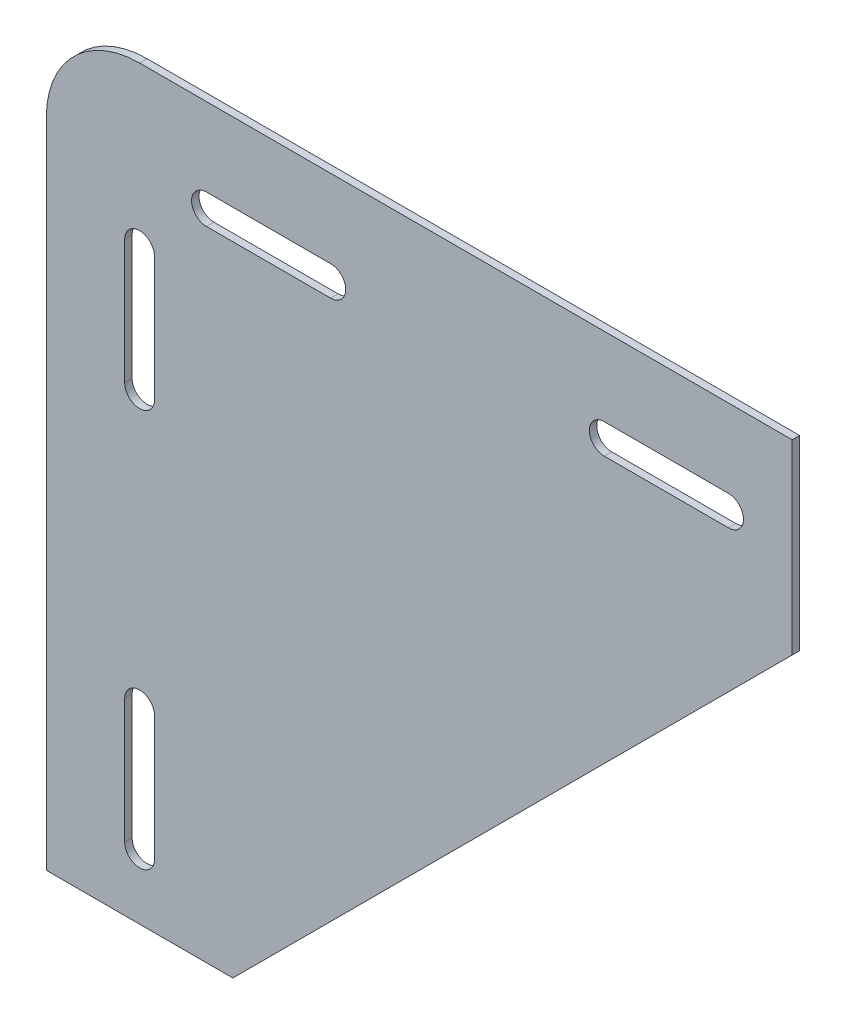
ISO-10303-21;
HEADER;
FILE_DESCRIPTION(('STEP AP214'),'2;1');
FILE_NAME('part.step','',(''),(''),'','','');
FILE_SCHEMA(('AUTOMOTIVE_DESIGN { 1 0 10303 214 1 1 1 1 }'));
ENDSEC;
DATA;
#1=APPLICATION_CONTEXT('core data for automotive mechanical design processes');
#2=APPLICATION_PROTOCOL_DEFINITION('international standard','automotive_design',2000,#1);
#3=PRODUCT_CONTEXT('',#1,'mechanical');
#4=PRODUCT('Part','Part','',(#3));
#5=PRODUCT_RELATED_PRODUCT_CATEGORY('part','',(#4));
#6=PRODUCT_DEFINITION_FORMATION('','',#4);
#7=PRODUCT_DEFINITION_CONTEXT('part definition',#1,'design');
#8=PRODUCT_DEFINITION('design','',#6,#7);
#9=PRODUCT_DEFINITION_SHAPE('','',#8);
#10=(LENGTH_UNIT() NAMED_UNIT(*) SI_UNIT(.MILLI.,.METRE.));
#11=(NAMED_UNIT(*) PLANE_ANGLE_UNIT() SI_UNIT($,.RADIAN.));
#12=(NAMED_UNIT(*) SI_UNIT($,.STERADIAN.) SOLID_ANGLE_UNIT());
#13=UNCERTAINTY_MEASURE_WITH_UNIT(LENGTH_MEASURE(1.E-05),#10,'distance_accuracy_value','');
#14=(GEOMETRIC_REPRESENTATION_CONTEXT(3) GLOBAL_UNCERTAINTY_ASSIGNED_CONTEXT((#13)) GLOBAL_UNIT_ASSIGNED_CONTEXT((#10,
#11,#12)) REPRESENTATION_CONTEXT('',''));
#15=CARTESIAN_POINT('',(0.,0.,0.));
#16=DIRECTION('',(0.,0.,1.));
#17=DIRECTION('',(1.,0.,0.));
#18=AXIS2_PLACEMENT_3D('',#15,#16,#17);
#19=CARTESIAN_POINT('',(9.525,-9.525,0.762));
#20=DIRECTION('',(0.,0.,-1.));
#21=DIRECTION('',(-1.,0.,0.));
#22=AXIS2_PLACEMENT_3D('',#19,#20,#21);
#23=PLANE('',#22);
#24=CARTESIAN_POINT('',(29.0576,-9.525,0.762));
#25=DIRECTION('',(0.,0.,1.));
#26=DIRECTION('',(1.,0.,0.));
#27=AXIS2_PLACEMENT_3D('',#24,#25,#26);
#28=CIRCLE('',#27,1.524);
#29=CARTESIAN_POINT('',(29.0576,-11.049,0.762));
#30=VERTEX_POINT('',#29);
#31=CARTESIAN_POINT('',(29.0576,-8.001,0.762));
#32=VERTEX_POINT('',#31);
#33=EDGE_CURVE('E217',#30,#32,#28,.T.);
#34=ORIENTED_EDGE('',*,*,#33,.F.);
#35=DIRECTION('',(1.,0.,0.));
#36=VECTOR('',#35,1.);
#37=CARTESIAN_POINT('',(29.0576,-11.049,0.762));
#38=LINE('',#37,#36);
#39=CARTESIAN_POINT('',(16.3576,-11.049,0.762));
#40=VERTEX_POINT('',#39);
#41=EDGE_CURVE('E225',#40,#30,#38,.T.);
#42=ORIENTED_EDGE('',*,*,#41,.F.);
#43=CARTESIAN_POINT('',(16.3576,-9.525,0.762));
#44=DIRECTION('',(0.,0.,1.));
#45=DIRECTION('',(1.,0.,0.));
#46=AXIS2_PLACEMENT_3D('',#43,#44,#45);
#47=CIRCLE('',#46,1.524);
#48=CARTESIAN_POINT('',(16.3576,-8.001,0.762));
#49=VERTEX_POINT('',#48);
#50=EDGE_CURVE('E222',#49,#40,#47,.T.);
#51=ORIENTED_EDGE('',*,*,#50,.F.);
#52=DIRECTION('',(-1.,0.,0.));
#53=VECTOR('',#52,1.);
#54=CARTESIAN_POINT('',(29.0576,-8.001,0.762));
#55=LINE('',#54,#53);
#56=EDGE_CURVE('E219',#32,#49,#55,.T.);
#57=ORIENTED_EDGE('',*,*,#56,.F.);
#58=EDGE_LOOP('',(#34,#42,#51,#57));
#59=FACE_BOUND('',#58,.T.);
#60=CARTESIAN_POINT('',(56.9976,-9.525,0.762));
#61=DIRECTION('',(0.,0.,1.));
#62=DIRECTION('',(1.,0.,0.));
#63=AXIS2_PLACEMENT_3D('',#60,#61,#62);
#64=CIRCLE('',#63,1.52399999999999);
#65=CARTESIAN_POINT('',(56.9976,-8.001,0.762));
#66=VERTEX_POINT('',#65);
#67=CARTESIAN_POINT('',(56.9976,-11.049,0.762));
#68=VERTEX_POINT('',#67);
#69=EDGE_CURVE('E279',#66,#68,#64,.T.);
#70=ORIENTED_EDGE('',*,*,#69,.F.);
#71=DIRECTION('',(-1.,0.,0.));
#72=VECTOR('',#71,1.);
#73=CARTESIAN_POINT('',(56.9976,-8.001,0.762));
#74=LINE('',#73,#72);
#75=CARTESIAN_POINT('',(69.6976,-8.001,0.762));
#76=VERTEX_POINT('',#75);
#77=EDGE_CURVE('E287',#76,#66,#74,.T.);
#78=ORIENTED_EDGE('',*,*,#77,.F.);
#79=CARTESIAN_POINT('',(69.6976,-9.525,0.762));
#80=DIRECTION('',(0.,0.,1.));
#81=DIRECTION('',(1.,0.,0.));
#82=AXIS2_PLACEMENT_3D('',#79,#80,#81);
#83=CIRCLE('',#82,1.524);
#84=CARTESIAN_POINT('',(69.6976,-11.049,0.762));
#85=VERTEX_POINT('',#84);
#86=EDGE_CURVE('E284',#85,#76,#83,.T.);
#87=ORIENTED_EDGE('',*,*,#86,.F.);
#88=DIRECTION('',(1.,0.,0.));
#89=VECTOR('',#88,1.);
#90=CARTESIAN_POINT('',(56.9976,-11.049,0.762));
#91=LINE('',#90,#89);
#92=EDGE_CURVE('E281',#68,#85,#91,.T.);
#93=ORIENTED_EDGE('',*,*,#92,.F.);
#94=EDGE_LOOP('',(#70,#78,#87,#93));
#95=FACE_BOUND('',#94,.T.);
#96=DIRECTION('',(1.,0.,0.));
#97=VECTOR('',#96,1.);
#98=CARTESIAN_POINT('',(19.05,-76.2,0.762));
#99=LINE('',#98,#97);
#100=CARTESIAN_POINT('',(0.,-76.2,0.762));
#101=VERTEX_POINT('',#100);
#102=CARTESIAN_POINT('',(19.05,-76.2,0.762));
#103=VERTEX_POINT('',#102);
#104=EDGE_CURVE('E310',#101,#103,#99,.T.);
#105=ORIENTED_EDGE('',*,*,#104,.T.);
#106=DIRECTION('',(0.707106781186548,0.707106781186548,0.));
#107=VECTOR('',#106,1.);
#108=CARTESIAN_POINT('',(76.2,-19.05,0.762));
#109=LINE('',#108,#107);
#110=CARTESIAN_POINT('',(76.2,-19.05,0.762));
#111=VERTEX_POINT('',#110);
#112=EDGE_CURVE('E313',#103,#111,#109,.T.);
#113=ORIENTED_EDGE('',*,*,#112,.T.);
#114=DIRECTION('',(0.,1.,0.));
#115=VECTOR('',#114,1.);
#116=CARTESIAN_POINT('',(76.2,0.,0.762));
#117=LINE('',#116,#115);
#118=CARTESIAN_POINT('',(76.2,0.,0.762));
#119=VERTEX_POINT('',#118);
#120=EDGE_CURVE('E316',#111,#119,#117,.T.);
#121=ORIENTED_EDGE('',*,*,#120,.T.);
#122=DIRECTION('',(-1.,0.,0.));
#123=VECTOR('',#122,1.);
#124=CARTESIAN_POINT('',(9.525,0.,0.762));
#125=LINE('',#124,#123);
#126=CARTESIAN_POINT('',(9.525,0.,0.762));
#127=VERTEX_POINT('',#126);
#128=EDGE_CURVE('E318',#119,#127,#125,.T.);
#129=ORIENTED_EDGE('',*,*,#128,.T.);
#130=CARTESIAN_POINT('',(9.525,-9.525,0.762));
#131=DIRECTION('',(0.,0.,1.));
#132=DIRECTION('',(-1.,0.,0.));
#133=AXIS2_PLACEMENT_3D('',#130,#131,#132);
#134=CIRCLE('',#133,9.525);
#135=CARTESIAN_POINT('',(0.,-9.525,0.762));
#136=VERTEX_POINT('',#135);
#137=EDGE_CURVE('E320',#127,#136,#134,.T.);
#138=ORIENTED_EDGE('',*,*,#137,.T.);
#139=DIRECTION('',(0.,-1.,0.));
#140=VECTOR('',#139,1.);
#141=CARTESIAN_POINT('',(0.,-76.2,0.762));
#142=LINE('',#141,#140);
#143=EDGE_CURVE('E322',#136,#101,#142,.T.);
#144=ORIENTED_EDGE('',*,*,#143,.T.);
#145=EDGE_LOOP('',(#105,#113,#121,#129,#138,#144));
#146=FACE_BOUND('',#145,.T.);
#147=CARTESIAN_POINT('',(9.52500000000001,-56.9976,0.762));
#148=DIRECTION('',(0.,0.,1.));
#149=DIRECTION('',(-1.,0.,0.));
#150=AXIS2_PLACEMENT_3D('',#147,#148,#149);
#151=CIRCLE('',#150,1.52399999999999);
#152=CARTESIAN_POINT('',(11.049,-56.9976,0.762));
#153=VERTEX_POINT('',#152);
#154=CARTESIAN_POINT('',(8.00100000000002,-56.9976,0.762));
#155=VERTEX_POINT('',#154);
#156=EDGE_CURVE('E248',#153,#155,#151,.T.);
#157=ORIENTED_EDGE('',*,*,#156,.F.);
#158=DIRECTION('',(0.,1.,0.));
#159=VECTOR('',#158,1.);
#160=CARTESIAN_POINT('',(11.049,-56.9976,0.762));
#161=LINE('',#160,#159);
#162=CARTESIAN_POINT('',(11.049,-69.6976,0.762));
#163=VERTEX_POINT('',#162);
#164=EDGE_CURVE('E256',#163,#153,#161,.T.);
#165=ORIENTED_EDGE('',*,*,#164,.F.);
#166=CARTESIAN_POINT('',(9.52500000000001,-69.6976,0.762));
#167=DIRECTION('',(0.,0.,1.));
#168=DIRECTION('',(-1.,0.,0.));
#169=AXIS2_PLACEMENT_3D('',#166,#167,#168);
#170=CIRCLE('',#169,1.52399999999999);
#171=CARTESIAN_POINT('',(8.00100000000002,-69.6976,0.762));
#172=VERTEX_POINT('',#171);
#173=EDGE_CURVE('E253',#172,#163,#170,.T.);
#174=ORIENTED_EDGE('',*,*,#173,.F.);
#175=DIRECTION('',(0.,-1.,0.));
#176=VECTOR('',#175,1.);
#177=CARTESIAN_POINT('',(8.00100000000002,-56.9976,0.762));
#178=LINE('',#177,#176);
#179=EDGE_CURVE('E250',#155,#172,#178,.T.);
#180=ORIENTED_EDGE('',*,*,#179,.F.);
#181=EDGE_LOOP('',(#157,#165,#174,#180));
#182=FACE_BOUND('',#181,.T.);
#183=CARTESIAN_POINT('',(9.525,-29.0576,0.762));
#184=DIRECTION('',(0.,0.,1.));
#185=DIRECTION('',(-1.,0.,0.));
#186=AXIS2_PLACEMENT_3D('',#183,#184,#185);
#187=CIRCLE('',#186,1.524);
#188=CARTESIAN_POINT('',(8.001,-29.0576,0.762));
#189=VERTEX_POINT('',#188);
#190=CARTESIAN_POINT('',(11.049,-29.0576,0.762));
#191=VERTEX_POINT('',#190);
#192=EDGE_CURVE('E181',#189,#191,#187,.T.);
#193=ORIENTED_EDGE('',*,*,#192,.F.);
#194=DIRECTION('',(0.,-1.,0.));
#195=VECTOR('',#194,1.);
#196=CARTESIAN_POINT('',(8.001,-29.0576,0.762));
#197=LINE('',#196,#195);
#198=CARTESIAN_POINT('',(8.00100000000001,-16.3576,0.762));
#199=VERTEX_POINT('',#198);
#200=EDGE_CURVE('E203',#199,#189,#197,.T.);
#201=ORIENTED_EDGE('',*,*,#200,.F.);
#202=CARTESIAN_POINT('',(9.525,-16.3576,0.762));
#203=DIRECTION('',(0.,0.,1.));
#204=DIRECTION('',(-1.,0.,0.));
#205=AXIS2_PLACEMENT_3D('',#202,#203,#204);
#206=CIRCLE('',#205,1.52399999999999);
#207=CARTESIAN_POINT('',(11.049,-16.3576,0.762));
#208=VERTEX_POINT('',#207);
#209=EDGE_CURVE('E201',#208,#199,#206,.T.);
#210=ORIENTED_EDGE('',*,*,#209,.F.);
#211=DIRECTION('',(0.,1.,0.));
#212=VECTOR('',#211,1.);
#213=CARTESIAN_POINT('',(11.049,-29.0576,0.762));
#214=LINE('',#213,#212);
#215=EDGE_CURVE('E189',#191,#208,#214,.T.);
#216=ORIENTED_EDGE('',*,*,#215,.F.);
#217=EDGE_LOOP('',(#193,#201,#210,#216));
#218=FACE_BOUND('',#217,.T.);
#219=ADVANCED_FACE('F32',(#59,#95,#146,#182,#218),#23,.F.);
#220=CARTESIAN_POINT('',(9.525,-9.525,0.));
#221=DIRECTION('',(0.,0.,-1.));
#222=DIRECTION('',(-1.,0.,0.));
#223=AXIS2_PLACEMENT_3D('',#220,#221,#222);
#224=PLANE('',#223);
#225=DIRECTION('',(1.,0.,0.));
#226=VECTOR('',#225,1.);
#227=CARTESIAN_POINT('',(29.0576,-11.049,0.));
#228=LINE('',#227,#226);
#229=CARTESIAN_POINT('',(16.3576,-11.049,0.));
#230=VERTEX_POINT('',#229);
#231=CARTESIAN_POINT('',(29.0576,-11.049,0.));
#232=VERTEX_POINT('',#231);
#233=EDGE_CURVE('E220',#230,#232,#228,.T.);
#234=ORIENTED_EDGE('',*,*,#233,.T.);
#235=CARTESIAN_POINT('',(29.0576,-9.525,0.));
#236=DIRECTION('',(0.,0.,1.));
#237=DIRECTION('',(1.,0.,0.));
#238=AXIS2_PLACEMENT_3D('',#235,#236,#237);
#239=CIRCLE('',#238,1.524);
#240=CARTESIAN_POINT('',(29.0576,-8.001,0.));
#241=VERTEX_POINT('',#240);
#242=EDGE_CURVE('E197',#232,#241,#239,.T.);
#243=ORIENTED_EDGE('',*,*,#242,.T.);
#244=DIRECTION('',(-1.,0.,0.));
#245=VECTOR('',#244,1.);
#246=CARTESIAN_POINT('',(29.0576,-8.001,0.));
#247=LINE('',#246,#245);
#248=CARTESIAN_POINT('',(16.3576,-8.001,0.));
#249=VERTEX_POINT('',#248);
#250=EDGE_CURVE('E230',#241,#249,#247,.T.);
#251=ORIENTED_EDGE('',*,*,#250,.T.);
#252=CARTESIAN_POINT('',(16.3576,-9.525,0.));
#253=DIRECTION('',(0.,0.,1.));
#254=DIRECTION('',(1.,0.,0.));
#255=AXIS2_PLACEMENT_3D('',#252,#253,#254);
#256=CIRCLE('',#255,1.524);
#257=EDGE_CURVE('E233',#249,#230,#256,.T.);
#258=ORIENTED_EDGE('',*,*,#257,.T.);
#259=EDGE_LOOP('',(#234,#243,#251,#258));
#260=FACE_BOUND('',#259,.T.);
#261=DIRECTION('',(-1.,0.,0.));
#262=VECTOR('',#261,1.);
#263=CARTESIAN_POINT('',(56.9976,-8.001,0.));
#264=LINE('',#263,#262);
#265=CARTESIAN_POINT('',(69.6976,-8.001,0.));
#266=VERTEX_POINT('',#265);
#267=CARTESIAN_POINT('',(56.9976,-8.00100000000001,0.));
#268=VERTEX_POINT('',#267);
#269=EDGE_CURVE('E282',#266,#268,#264,.T.);
#270=ORIENTED_EDGE('',*,*,#269,.T.);
#271=CARTESIAN_POINT('',(56.9976,-9.525,0.));
#272=DIRECTION('',(0.,0.,1.));
#273=DIRECTION('',(1.,0.,0.));
#274=AXIS2_PLACEMENT_3D('',#271,#272,#273);
#275=CIRCLE('',#274,1.52399999999999);
#276=CARTESIAN_POINT('',(56.9976,-11.049,0.));
#277=VERTEX_POINT('',#276);
#278=EDGE_CURVE('E278',#268,#277,#275,.T.);
#279=ORIENTED_EDGE('',*,*,#278,.T.);
#280=DIRECTION('',(1.,0.,0.));
#281=VECTOR('',#280,1.);
#282=CARTESIAN_POINT('',(56.9976,-11.049,0.));
#283=LINE('',#282,#281);
#284=CARTESIAN_POINT('',(69.6976,-11.049,0.));
#285=VERTEX_POINT('',#284);
#286=EDGE_CURVE('E292',#277,#285,#283,.T.);
#287=ORIENTED_EDGE('',*,*,#286,.T.);
#288=CARTESIAN_POINT('',(69.6976,-9.525,0.));
#289=DIRECTION('',(0.,0.,1.));
#290=DIRECTION('',(1.,0.,0.));
#291=AXIS2_PLACEMENT_3D('',#288,#289,#290);
#292=CIRCLE('',#291,1.524);
#293=EDGE_CURVE('E295',#285,#266,#292,.T.);
#294=ORIENTED_EDGE('',*,*,#293,.T.);
#295=EDGE_LOOP('',(#270,#279,#287,#294));
#296=FACE_BOUND('',#295,.T.);
#297=DIRECTION('',(1.,0.,0.));
#298=VECTOR('',#297,1.);
#299=CARTESIAN_POINT('',(19.05,-76.2,0.));
#300=LINE('',#299,#298);
#301=CARTESIAN_POINT('',(0.,-76.2,0.));
#302=VERTEX_POINT('',#301);
#303=CARTESIAN_POINT('',(19.05,-76.2,0.));
#304=VERTEX_POINT('',#303);
#305=EDGE_CURVE('E309',#302,#304,#300,.T.);
#306=ORIENTED_EDGE('',*,*,#305,.F.);
#307=DIRECTION('',(0.,-1.,0.));
#308=VECTOR('',#307,1.);
#309=CARTESIAN_POINT('',(0.,-76.2,0.));
#310=LINE('',#309,#308);
#311=CARTESIAN_POINT('',(0.,-9.525,0.));
#312=VERTEX_POINT('',#311);
#313=EDGE_CURVE('E314',#312,#302,#310,.T.);
#314=ORIENTED_EDGE('',*,*,#313,.F.);
#315=CARTESIAN_POINT('',(9.525,-9.525,0.));
#316=DIRECTION('',(0.,0.,1.));
#317=DIRECTION('',(-1.,0.,0.));
#318=AXIS2_PLACEMENT_3D('',#315,#316,#317);
#319=CIRCLE('',#318,9.525);
#320=CARTESIAN_POINT('',(9.525,0.,0.));
#321=VERTEX_POINT('',#320);
#322=EDGE_CURVE('E333',#321,#312,#319,.T.);
#323=ORIENTED_EDGE('',*,*,#322,.F.);
#324=DIRECTION('',(-1.,0.,0.));
#325=VECTOR('',#324,1.);
#326=CARTESIAN_POINT('',(9.525,0.,0.));
#327=LINE('',#326,#325);
#328=CARTESIAN_POINT('',(76.2,0.,0.));
#329=VERTEX_POINT('',#328);
#330=EDGE_CURVE('E331',#329,#321,#327,.T.);
#331=ORIENTED_EDGE('',*,*,#330,.F.);
#332=DIRECTION('',(0.,1.,0.));
#333=VECTOR('',#332,1.);
#334=CARTESIAN_POINT('',(76.2,0.,0.));
#335=LINE('',#334,#333);
#336=CARTESIAN_POINT('',(76.2,-19.05,0.));
#337=VERTEX_POINT('',#336);
#338=EDGE_CURVE('E329',#337,#329,#335,.T.);
#339=ORIENTED_EDGE('',*,*,#338,.F.);
#340=DIRECTION('',(0.707106781186548,0.707106781186548,0.));
#341=VECTOR('',#340,1.);
#342=CARTESIAN_POINT('',(76.2,-19.05,0.));
#343=LINE('',#342,#341);
#344=EDGE_CURVE('E327',#304,#337,#343,.T.);
#345=ORIENTED_EDGE('',*,*,#344,.F.);
#346=EDGE_LOOP('',(#306,#314,#323,#331,#339,#345));
#347=FACE_BOUND('',#346,.T.);
#348=DIRECTION('',(0.,1.,0.));
#349=VECTOR('',#348,1.);
#350=CARTESIAN_POINT('',(11.049,-56.9976,0.));
#351=LINE('',#350,#349);
#352=CARTESIAN_POINT('',(11.049,-69.6976,0.));
#353=VERTEX_POINT('',#352);
#354=CARTESIAN_POINT('',(11.049,-56.9976,0.));
#355=VERTEX_POINT('',#354);
#356=EDGE_CURVE('E251',#353,#355,#351,.T.);
#357=ORIENTED_EDGE('',*,*,#356,.T.);
#358=CARTESIAN_POINT('',(9.52500000000001,-56.9976,0.));
#359=DIRECTION('',(0.,0.,1.));
#360=DIRECTION('',(-1.,0.,0.));
#361=AXIS2_PLACEMENT_3D('',#358,#359,#360);
#362=CIRCLE('',#361,1.52399999999999);
#363=CARTESIAN_POINT('',(8.00100000000002,-56.9976,0.));
#364=VERTEX_POINT('',#363);
#365=EDGE_CURVE('E247',#355,#364,#362,.T.);
#366=ORIENTED_EDGE('',*,*,#365,.T.);
#367=DIRECTION('',(0.,-1.,0.));
#368=VECTOR('',#367,1.);
#369=CARTESIAN_POINT('',(8.00100000000002,-56.9976,0.));
#370=LINE('',#369,#368);
#371=CARTESIAN_POINT('',(8.00100000000002,-69.6976,0.));
#372=VERTEX_POINT('',#371);
#373=EDGE_CURVE('E261',#364,#372,#370,.T.);
#374=ORIENTED_EDGE('',*,*,#373,.T.);
#375=CARTESIAN_POINT('',(9.52500000000001,-69.6976,0.));
#376=DIRECTION('',(0.,0.,1.));
#377=DIRECTION('',(-1.,0.,0.));
#378=AXIS2_PLACEMENT_3D('',#375,#376,#377);
#379=CIRCLE('',#378,1.52399999999999);
#380=EDGE_CURVE('E264',#372,#353,#379,.T.);
#381=ORIENTED_EDGE('',*,*,#380,.T.);
#382=EDGE_LOOP('',(#357,#366,#374,#381));
#383=FACE_BOUND('',#382,.T.);
#384=DIRECTION('',(0.,-1.,0.));
#385=VECTOR('',#384,1.);
#386=CARTESIAN_POINT('',(8.001,-29.0576,0.));
#387=LINE('',#386,#385);
#388=CARTESIAN_POINT('',(8.00100000000001,-16.3576,0.));
#389=VERTEX_POINT('',#388);
#390=CARTESIAN_POINT('',(8.001,-29.0576,0.));
#391=VERTEX_POINT('',#390);
#392=EDGE_CURVE('E190',#389,#391,#387,.T.);
#393=ORIENTED_EDGE('',*,*,#392,.T.);
#394=CARTESIAN_POINT('',(9.525,-29.0576,0.));
#395=DIRECTION('',(0.,0.,1.));
#396=DIRECTION('',(-1.,0.,0.));
#397=AXIS2_PLACEMENT_3D('',#394,#395,#396);
#398=CIRCLE('',#397,1.524);
#399=CARTESIAN_POINT('',(11.049,-29.0576,0.));
#400=VERTEX_POINT('',#399);
#401=EDGE_CURVE('E55',#391,#400,#398,.T.);
#402=ORIENTED_EDGE('',*,*,#401,.T.);
#403=DIRECTION('',(0.,1.,0.));
#404=VECTOR('',#403,1.);
#405=CARTESIAN_POINT('',(11.049,-29.0576,0.));
#406=LINE('',#405,#404);
#407=CARTESIAN_POINT('',(11.049,-16.3576,0.));
#408=VERTEX_POINT('',#407);
#409=EDGE_CURVE('E196',#400,#408,#406,.T.);
#410=ORIENTED_EDGE('',*,*,#409,.T.);
#411=CARTESIAN_POINT('',(9.525,-16.3576,0.));
#412=DIRECTION('',(0.,0.,1.));
#413=DIRECTION('',(-1.,0.,0.));
#414=AXIS2_PLACEMENT_3D('',#411,#412,#413);
#415=CIRCLE('',#414,1.52399999999999);
#416=EDGE_CURVE('E209',#408,#389,#415,.T.);
#417=ORIENTED_EDGE('',*,*,#416,.T.);
#418=EDGE_LOOP('',(#393,#402,#410,#417));
#419=FACE_BOUND('',#418,.T.);
#420=ADVANCED_FACE('F357',(#260,#296,#347,#383,#419),#224,.T.);
#421=CARTESIAN_POINT('',(19.05,-76.2,0.762));
#422=DIRECTION('',(0.,1.,0.));
#423=DIRECTION('',(0.,0.,1.));
#424=AXIS2_PLACEMENT_3D('',#421,#422,#423);
#425=PLANE('',#424);
#426=ORIENTED_EDGE('',*,*,#305,.T.);
#427=DIRECTION('',(0.,0.,-1.));
#428=VECTOR('',#427,1.);
#429=CARTESIAN_POINT('',(19.05,-76.2,0.762));
#430=LINE('',#429,#428);
#431=EDGE_CURVE('E11',#103,#304,#430,.T.);
#432=ORIENTED_EDGE('',*,*,#431,.F.);
#433=ORIENTED_EDGE('',*,*,#104,.F.);
#434=DIRECTION('',(0.,0.,-1.));
#435=VECTOR('',#434,1.);
#436=CARTESIAN_POINT('',(0.,-76.2,0.762));
#437=LINE('',#436,#435);
#438=EDGE_CURVE('E324',#101,#302,#437,.T.);
#439=ORIENTED_EDGE('',*,*,#438,.T.);
#440=EDGE_LOOP('',(#426,#432,#433,#439));
#441=FACE_BOUND('',#440,.T.);
#442=ADVANCED_FACE('F34',(#441),#425,.F.);
#443=CARTESIAN_POINT('',(76.2,-19.05,0.762));
#444=DIRECTION('',(-0.707106781186547,0.707106781186547,0.));
#445=DIRECTION('',(-0.707106781186548,-0.707106781186548,0.));
#446=AXIS2_PLACEMENT_3D('',#443,#444,#445);
#447=PLANE('',#446);
#448=ORIENTED_EDGE('',*,*,#344,.T.);
#449=DIRECTION('',(0.,0.,-1.));
#450=VECTOR('',#449,1.);
#451=CARTESIAN_POINT('',(76.2,-19.05,0.762));
#452=LINE('',#451,#450);
#453=EDGE_CURVE('E40',#111,#337,#452,.T.);
#454=ORIENTED_EDGE('',*,*,#453,.F.);
#455=ORIENTED_EDGE('',*,*,#112,.F.);
#456=ORIENTED_EDGE('',*,*,#431,.T.);
#457=EDGE_LOOP('',(#448,#454,#455,#456));
#458=FACE_BOUND('',#457,.T.);
#459=ADVANCED_FACE('F375',(#458),#447,.F.);
#460=CARTESIAN_POINT('',(76.2,0.,0.762));
#461=DIRECTION('',(-1.,0.,0.));
#462=DIRECTION('',(0.,0.,1.));
#463=AXIS2_PLACEMENT_3D('',#460,#461,#462);
#464=PLANE('',#463);
#465=ORIENTED_EDGE('',*,*,#338,.T.);
#466=DIRECTION('',(0.,0.,-1.));
#467=VECTOR('',#466,1.);
#468=CARTESIAN_POINT('',(76.2,0.,0.762));
#469=LINE('',#468,#467);
#470=EDGE_CURVE('E344',#119,#329,#469,.T.);
#471=ORIENTED_EDGE('',*,*,#470,.F.);
#472=ORIENTED_EDGE('',*,*,#120,.F.);
#473=ORIENTED_EDGE('',*,*,#453,.T.);
#474=EDGE_LOOP('',(#465,#471,#472,#473));
#475=FACE_BOUND('',#474,.T.);
#476=ADVANCED_FACE('F351',(#475),#464,.F.);
#477=CARTESIAN_POINT('',(9.525,0.,0.762));
#478=DIRECTION('',(0.,-1.,0.));
#479=DIRECTION('',(1.,0.,0.));
#480=AXIS2_PLACEMENT_3D('',#477,#478,#479);
#481=PLANE('',#480);
#482=ORIENTED_EDGE('',*,*,#330,.T.);
#483=DIRECTION('',(0.,0.,-1.));
#484=VECTOR('',#483,1.);
#485=CARTESIAN_POINT('',(9.525,0.,0.762));
#486=LINE('',#485,#484);
#487=EDGE_CURVE('E341',#127,#321,#486,.T.);
#488=ORIENTED_EDGE('',*,*,#487,.F.);
#489=ORIENTED_EDGE('',*,*,#128,.F.);
#490=ORIENTED_EDGE('',*,*,#470,.T.);
#491=EDGE_LOOP('',(#482,#488,#489,#490));
#492=FACE_BOUND('',#491,.T.);
#493=ADVANCED_FACE('F363',(#492),#481,.F.);
#494=CARTESIAN_POINT('',(9.525,-9.525,0.762));
#495=DIRECTION('',(0.,0.,-1.));
#496=DIRECTION('',(-1.,0.,0.));
#497=AXIS2_PLACEMENT_3D('',#494,#495,#496);
#498=CYLINDRICAL_SURFACE('',#497,9.525);
#499=ORIENTED_EDGE('',*,*,#322,.T.);
#500=DIRECTION('',(0.,0.,-1.));
#501=VECTOR('',#500,1.);
#502=CARTESIAN_POINT('',(0.,-9.525,0.762));
#503=LINE('',#502,#501);
#504=EDGE_CURVE('E338',#136,#312,#503,.T.);
#505=ORIENTED_EDGE('',*,*,#504,.F.);
#506=ORIENTED_EDGE('',*,*,#137,.F.);
#507=ORIENTED_EDGE('',*,*,#487,.T.);
#508=EDGE_LOOP('',(#499,#505,#506,#507));
#509=FACE_BOUND('',#508,.T.);
#510=ADVANCED_FACE('F367',(#509),#498,.T.);
#511=CARTESIAN_POINT('',(0.,-76.2,0.762));
#512=DIRECTION('',(1.,0.,0.));
#513=DIRECTION('',(0.,0.,-1.));
#514=AXIS2_PLACEMENT_3D('',#511,#512,#513);
#515=PLANE('',#514);
#516=ORIENTED_EDGE('',*,*,#313,.T.);
#517=ORIENTED_EDGE('',*,*,#438,.F.);
#518=ORIENTED_EDGE('',*,*,#143,.F.);
#519=ORIENTED_EDGE('',*,*,#504,.T.);
#520=EDGE_LOOP('',(#516,#517,#518,#519));
#521=FACE_BOUND('',#520,.T.);
#522=ADVANCED_FACE('F378',(#521),#515,.F.);
#523=CARTESIAN_POINT('',(56.9976,-9.525,0.762));
#524=DIRECTION('',(0.,0.,-1.));
#525=DIRECTION('',(-1.,0.,0.));
#526=AXIS2_PLACEMENT_3D('',#523,#524,#525);
#527=CYLINDRICAL_SURFACE('',#526,1.52399999999999);
#528=ORIENTED_EDGE('',*,*,#278,.F.);
#529=DIRECTION('',(0.,0.,-1.));
#530=VECTOR('',#529,1.);
#531=CARTESIAN_POINT('',(56.9976,-8.001,0.762));
#532=LINE('',#531,#530);
#533=EDGE_CURVE('E289',#66,#268,#532,.T.);
#534=ORIENTED_EDGE('',*,*,#533,.F.);
#535=ORIENTED_EDGE('',*,*,#69,.T.);
#536=DIRECTION('',(0.,0.,-1.));
#537=VECTOR('',#536,1.);
#538=CARTESIAN_POINT('',(56.9976,-11.049,0.762));
#539=LINE('',#538,#537);
#540=EDGE_CURVE('E306',#68,#277,#539,.T.);
#541=ORIENTED_EDGE('',*,*,#540,.T.);
#542=EDGE_LOOP('',(#528,#534,#535,#541));
#543=FACE_BOUND('',#542,.T.);
#544=ADVANCED_FACE('F380',(#543),#527,.F.);
#545=CARTESIAN_POINT('',(56.9976,-11.049,0.762));
#546=DIRECTION('',(0.,1.,0.));
#547=DIRECTION('',(-1.,0.,0.));
#548=AXIS2_PLACEMENT_3D('',#545,#546,#547);
#549=PLANE('',#548);
#550=ORIENTED_EDGE('',*,*,#286,.F.);
#551=ORIENTED_EDGE('',*,*,#540,.F.);
#552=ORIENTED_EDGE('',*,*,#92,.T.);
#553=DIRECTION('',(0.,0.,-1.));
#554=VECTOR('',#553,1.);
#555=CARTESIAN_POINT('',(69.6976,-11.049,0.762));
#556=LINE('',#555,#554);
#557=EDGE_CURVE('E304',#85,#285,#556,.T.);
#558=ORIENTED_EDGE('',*,*,#557,.T.);
#559=EDGE_LOOP('',(#550,#551,#552,#558));
#560=FACE_BOUND('',#559,.T.);
#561=ADVANCED_FACE('F386',(#560),#549,.T.);
#562=CARTESIAN_POINT('',(69.6976,-9.525,0.762));
#563=DIRECTION('',(0.,0.,-1.));
#564=DIRECTION('',(-1.,0.,0.));
#565=AXIS2_PLACEMENT_3D('',#562,#563,#564);
#566=CYLINDRICAL_SURFACE('',#565,1.524);
#567=ORIENTED_EDGE('',*,*,#293,.F.);
#568=ORIENTED_EDGE('',*,*,#557,.F.);
#569=ORIENTED_EDGE('',*,*,#86,.T.);
#570=DIRECTION('',(0.,0.,-1.));
#571=VECTOR('',#570,1.);
#572=CARTESIAN_POINT('',(69.6976,-8.001,0.762));
#573=LINE('',#572,#571);
#574=EDGE_CURVE('E302',#76,#266,#573,.T.);
#575=ORIENTED_EDGE('',*,*,#574,.T.);
#576=EDGE_LOOP('',(#567,#568,#569,#575));
#577=FACE_BOUND('',#576,.T.);
#578=ADVANCED_FACE('F403',(#577),#566,.F.);
#579=CARTESIAN_POINT('',(56.9976,-8.001,0.762));
#580=DIRECTION('',(0.,-1.,0.));
#581=DIRECTION('',(1.,0.,0.));
#582=AXIS2_PLACEMENT_3D('',#579,#580,#581);
#583=PLANE('',#582);
#584=ORIENTED_EDGE('',*,*,#269,.F.);
#585=ORIENTED_EDGE('',*,*,#574,.F.);
#586=ORIENTED_EDGE('',*,*,#77,.T.);
#587=ORIENTED_EDGE('',*,*,#533,.T.);
#588=EDGE_LOOP('',(#584,#585,#586,#587));
#589=FACE_BOUND('',#588,.T.);
#590=ADVANCED_FACE('F407',(#589),#583,.T.);
#591=CARTESIAN_POINT('',(9.52500000000001,-56.9976,0.762));
#592=DIRECTION('',(0.,0.,-1.));
#593=DIRECTION('',(-1.,0.,0.));
#594=AXIS2_PLACEMENT_3D('',#591,#592,#593);
#595=CYLINDRICAL_SURFACE('',#594,1.52399999999999);
#596=ORIENTED_EDGE('',*,*,#365,.F.);
#597=DIRECTION('',(0.,0.,-1.));
#598=VECTOR('',#597,1.);
#599=CARTESIAN_POINT('',(11.049,-56.9976,0.762));
#600=LINE('',#599,#598);
#601=EDGE_CURVE('E258',#153,#355,#600,.T.);
#602=ORIENTED_EDGE('',*,*,#601,.F.);
#603=ORIENTED_EDGE('',*,*,#156,.T.);
#604=DIRECTION('',(0.,0.,-1.));
#605=VECTOR('',#604,1.);
#606=CARTESIAN_POINT('',(8.00100000000002,-56.9976,0.762));
#607=LINE('',#606,#605);
#608=EDGE_CURVE('E275',#155,#364,#607,.T.);
#609=ORIENTED_EDGE('',*,*,#608,.T.);
#610=EDGE_LOOP('',(#596,#602,#603,#609));
#611=FACE_BOUND('',#610,.T.);
#612=ADVANCED_FACE('F411',(#611),#595,.F.);
#613=CARTESIAN_POINT('',(8.00100000000002,-56.9976,0.762));
#614=DIRECTION('',(1.,0.,0.));
#615=DIRECTION('',(0.,0.,-1.));
#616=AXIS2_PLACEMENT_3D('',#613,#614,#615);
#617=PLANE('',#616);
#618=ORIENTED_EDGE('',*,*,#373,.F.);
#619=ORIENTED_EDGE('',*,*,#608,.F.);
#620=ORIENTED_EDGE('',*,*,#179,.T.);
#621=DIRECTION('',(0.,0.,-1.));
#622=VECTOR('',#621,1.);
#623=CARTESIAN_POINT('',(8.00100000000002,-69.6976,0.762));
#624=LINE('',#623,#622);
#625=EDGE_CURVE('E273',#172,#372,#624,.T.);
#626=ORIENTED_EDGE('',*,*,#625,.T.);
#627=EDGE_LOOP('',(#618,#619,#620,#626));
#628=FACE_BOUND('',#627,.T.);
#629=ADVANCED_FACE('F415',(#628),#617,.T.);
#630=CARTESIAN_POINT('',(9.52500000000001,-69.6976,0.762));
#631=DIRECTION('',(0.,0.,-1.));
#632=DIRECTION('',(-1.,0.,0.));
#633=AXIS2_PLACEMENT_3D('',#630,#631,#632);
#634=CYLINDRICAL_SURFACE('',#633,1.52399999999999);
#635=ORIENTED_EDGE('',*,*,#380,.F.);
#636=ORIENTED_EDGE('',*,*,#625,.F.);
#637=ORIENTED_EDGE('',*,*,#173,.T.);
#638=DIRECTION('',(0.,0.,-1.));
#639=VECTOR('',#638,1.);
#640=CARTESIAN_POINT('',(11.049,-69.6976,0.762));
#641=LINE('',#640,#639);
#642=EDGE_CURVE('E271',#163,#353,#641,.T.);
#643=ORIENTED_EDGE('',*,*,#642,.T.);
#644=EDGE_LOOP('',(#635,#636,#637,#643));
#645=FACE_BOUND('',#644,.T.);
#646=ADVANCED_FACE('F419',(#645),#634,.F.);
#647=CARTESIAN_POINT('',(11.049,-56.9976,0.762));
#648=DIRECTION('',(-1.,0.,0.));
#649=DIRECTION('',(0.,0.,1.));
#650=AXIS2_PLACEMENT_3D('',#647,#648,#649);
#651=PLANE('',#650);
#652=ORIENTED_EDGE('',*,*,#356,.F.);
#653=ORIENTED_EDGE('',*,*,#642,.F.);
#654=ORIENTED_EDGE('',*,*,#164,.T.);
#655=ORIENTED_EDGE('',*,*,#601,.T.);
#656=EDGE_LOOP('',(#652,#653,#654,#655));
#657=FACE_BOUND('',#656,.T.);
#658=ADVANCED_FACE('F423',(#657),#651,.T.);
#659=CARTESIAN_POINT('',(29.0576,-9.525,0.762));
#660=DIRECTION('',(0.,0.,-1.));
#661=DIRECTION('',(-1.,0.,0.));
#662=AXIS2_PLACEMENT_3D('',#659,#660,#661);
#663=CYLINDRICAL_SURFACE('',#662,1.524);
#664=ORIENTED_EDGE('',*,*,#242,.F.);
#665=DIRECTION('',(0.,0.,-1.));
#666=VECTOR('',#665,1.);
#667=CARTESIAN_POINT('',(29.0576,-11.049,0.762));
#668=LINE('',#667,#666);
#669=EDGE_CURVE('E227',#30,#232,#668,.T.);
#670=ORIENTED_EDGE('',*,*,#669,.F.);
#671=ORIENTED_EDGE('',*,*,#33,.T.);
#672=DIRECTION('',(0.,0.,-1.));
#673=VECTOR('',#672,1.);
#674=CARTESIAN_POINT('',(29.0576,-8.001,0.762));
#675=LINE('',#674,#673);
#676=EDGE_CURVE('E244',#32,#241,#675,.T.);
#677=ORIENTED_EDGE('',*,*,#676,.T.);
#678=EDGE_LOOP('',(#664,#670,#671,#677));
#679=FACE_BOUND('',#678,.T.);
#680=ADVANCED_FACE('F427',(#679),#663,.F.);
#681=CARTESIAN_POINT('',(29.0576,-8.001,0.762));
#682=DIRECTION('',(0.,-1.,0.));
#683=DIRECTION('',(1.,0.,0.));
#684=AXIS2_PLACEMENT_3D('',#681,#682,#683);
#685=PLANE('',#684);
#686=ORIENTED_EDGE('',*,*,#250,.F.);
#687=ORIENTED_EDGE('',*,*,#676,.F.);
#688=ORIENTED_EDGE('',*,*,#56,.T.);
#689=DIRECTION('',(0.,0.,-1.));
#690=VECTOR('',#689,1.);
#691=CARTESIAN_POINT('',(16.3576,-8.001,0.762));
#692=LINE('',#691,#690);
#693=EDGE_CURVE('E242',#49,#249,#692,.T.);
#694=ORIENTED_EDGE('',*,*,#693,.T.);
#695=EDGE_LOOP('',(#686,#687,#688,#694));
#696=FACE_BOUND('',#695,.T.);
#697=ADVANCED_FACE('F431',(#696),#685,.T.);
#698=CARTESIAN_POINT('',(16.3576,-9.525,0.762));
#699=DIRECTION('',(0.,0.,-1.));
#700=DIRECTION('',(-1.,0.,0.));
#701=AXIS2_PLACEMENT_3D('',#698,#699,#700);
#702=CYLINDRICAL_SURFACE('',#701,1.524);
#703=ORIENTED_EDGE('',*,*,#257,.F.);
#704=ORIENTED_EDGE('',*,*,#693,.F.);
#705=ORIENTED_EDGE('',*,*,#50,.T.);
#706=DIRECTION('',(0.,0.,-1.));
#707=VECTOR('',#706,1.);
#708=CARTESIAN_POINT('',(16.3576,-11.049,0.762));
#709=LINE('',#708,#707);
#710=EDGE_CURVE('E240',#40,#230,#709,.T.);
#711=ORIENTED_EDGE('',*,*,#710,.T.);
#712=EDGE_LOOP('',(#703,#704,#705,#711));
#713=FACE_BOUND('',#712,.T.);
#714=ADVANCED_FACE('F435',(#713),#702,.F.);
#715=CARTESIAN_POINT('',(29.0576,-11.049,0.762));
#716=DIRECTION('',(0.,1.,0.));
#717=DIRECTION('',(-1.,0.,0.));
#718=AXIS2_PLACEMENT_3D('',#715,#716,#717);
#719=PLANE('',#718);
#720=ORIENTED_EDGE('',*,*,#233,.F.);
#721=ORIENTED_EDGE('',*,*,#710,.F.);
#722=ORIENTED_EDGE('',*,*,#41,.T.);
#723=ORIENTED_EDGE('',*,*,#669,.T.);
#724=EDGE_LOOP('',(#720,#721,#722,#723));
#725=FACE_BOUND('',#724,.T.);
#726=ADVANCED_FACE('F439',(#725),#719,.T.);
#727=CARTESIAN_POINT('',(9.525,-29.0576,0.762));
#728=DIRECTION('',(0.,0.,-1.));
#729=DIRECTION('',(-1.,0.,0.));
#730=AXIS2_PLACEMENT_3D('',#727,#728,#729);
#731=CYLINDRICAL_SURFACE('',#730,1.524);
#732=ORIENTED_EDGE('',*,*,#401,.F.);
#733=DIRECTION('',(0.,0.,-1.));
#734=VECTOR('',#733,1.);
#735=CARTESIAN_POINT('',(8.001,-29.0576,0.762));
#736=LINE('',#735,#734);
#737=EDGE_CURVE('E185',#189,#391,#736,.T.);
#738=ORIENTED_EDGE('',*,*,#737,.F.);
#739=ORIENTED_EDGE('',*,*,#192,.T.);
#740=DIRECTION('',(0.,0.,-1.));
#741=VECTOR('',#740,1.);
#742=CARTESIAN_POINT('',(11.049,-29.0576,0.762));
#743=LINE('',#742,#741);
#744=EDGE_CURVE('E184',#191,#400,#743,.T.);
#745=ORIENTED_EDGE('',*,*,#744,.T.);
#746=EDGE_LOOP('',(#732,#738,#739,#745));
#747=FACE_BOUND('',#746,.T.);
#748=ADVANCED_FACE('F183',(#747),#731,.F.);
#749=CARTESIAN_POINT('',(11.049,-29.0576,0.762));
#750=DIRECTION('',(-1.,0.,0.));
#751=DIRECTION('',(0.,-1.,0.));
#752=AXIS2_PLACEMENT_3D('',#749,#750,#751);
#753=PLANE('',#752);
#754=ORIENTED_EDGE('',*,*,#409,.F.);
#755=ORIENTED_EDGE('',*,*,#744,.F.);
#756=ORIENTED_EDGE('',*,*,#215,.T.);
#757=DIRECTION('',(0.,0.,-1.));
#758=VECTOR('',#757,1.);
#759=CARTESIAN_POINT('',(11.049,-16.3576,0.762));
#760=LINE('',#759,#758);
#761=EDGE_CURVE('E198',#208,#408,#760,.T.);
#762=ORIENTED_EDGE('',*,*,#761,.T.);
#763=EDGE_LOOP('',(#754,#755,#756,#762));
#764=FACE_BOUND('',#763,.T.);
#765=ADVANCED_FACE('F193',(#764),#753,.T.);
#766=CARTESIAN_POINT('',(9.525,-16.3576,0.762));
#767=DIRECTION('',(0.,0.,-1.));
#768=DIRECTION('',(-1.,0.,0.));
#769=AXIS2_PLACEMENT_3D('',#766,#767,#768);
#770=CYLINDRICAL_SURFACE('',#769,1.52399999999999);
#771=ORIENTED_EDGE('',*,*,#416,.F.);
#772=ORIENTED_EDGE('',*,*,#761,.F.);
#773=ORIENTED_EDGE('',*,*,#209,.T.);
#774=DIRECTION('',(0.,0.,-1.));
#775=VECTOR('',#774,1.);
#776=CARTESIAN_POINT('',(8.00100000000001,-16.3576,0.762));
#777=LINE('',#776,#775);
#778=EDGE_CURVE('E47',#199,#389,#777,.T.);
#779=ORIENTED_EDGE('',*,*,#778,.T.);
#780=EDGE_LOOP('',(#771,#772,#773,#779));
#781=FACE_BOUND('',#780,.T.);
#782=ADVANCED_FACE('F448',(#781),#770,.F.);
#783=CARTESIAN_POINT('',(8.001,-29.0576,0.762));
#784=DIRECTION('',(1.,0.,0.));
#785=DIRECTION('',(0.,1.,0.));
#786=AXIS2_PLACEMENT_3D('',#783,#784,#785);
#787=PLANE('',#786);
#788=ORIENTED_EDGE('',*,*,#392,.F.);
#789=ORIENTED_EDGE('',*,*,#778,.F.);
#790=ORIENTED_EDGE('',*,*,#200,.T.);
#791=ORIENTED_EDGE('',*,*,#737,.T.);
#792=EDGE_LOOP('',(#788,#789,#790,#791));
#793=FACE_BOUND('',#792,.T.);
#794=ADVANCED_FACE('F451',(#793),#787,.T.);
#795=CLOSED_SHELL('',(#219,#420,#442,#459,#476,#493,#510,#522,#544,#561,#578,#590,#612,#629,
#646,#658,#680,#697,#714,#726,#748,#765,#782,#794));
#796=MANIFOLD_SOLID_BREP('B2',#795);
#797=ADVANCED_BREP_SHAPE_REPRESENTATION('',(#18,#796),#14);
#798=SHAPE_DEFINITION_REPRESENTATION(#9,#797);
ENDSEC;
END-ISO-10303-21;
